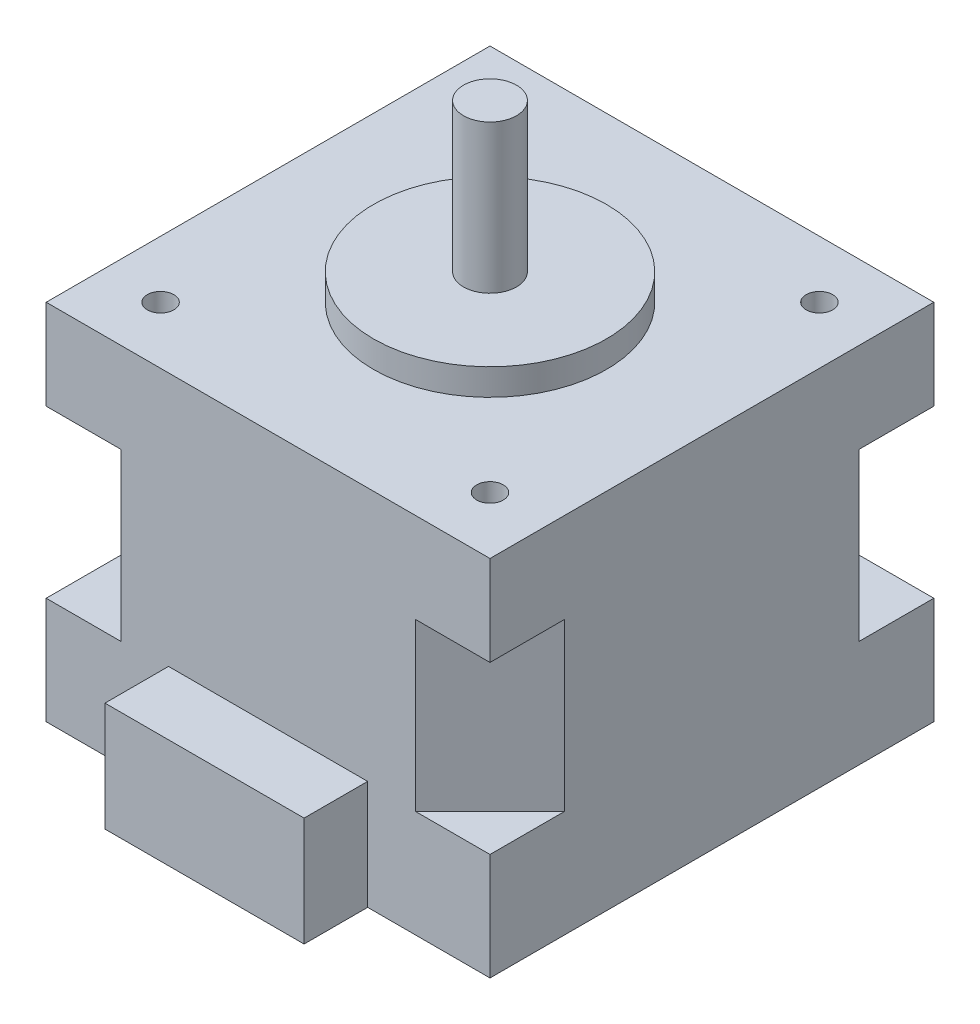
ISO-10303-21;
HEADER;
FILE_DESCRIPTION(('STEP AP214'),'2;1');
FILE_NAME('part.step','',(''),(''),'','','');
FILE_SCHEMA(('AUTOMOTIVE_DESIGN { 1 0 10303 214 1 1 1 1 }'));
ENDSEC;
DATA;
#1=APPLICATION_CONTEXT('core data for automotive mechanical design processes');
#2=APPLICATION_PROTOCOL_DEFINITION('international standard','automotive_design',2000,#1);
#3=PRODUCT_CONTEXT('',#1,'mechanical');
#4=PRODUCT('Part','Part','',(#3));
#5=PRODUCT_RELATED_PRODUCT_CATEGORY('part','',(#4));
#6=PRODUCT_DEFINITION_FORMATION('','',#4);
#7=PRODUCT_DEFINITION_CONTEXT('part definition',#1,'design');
#8=PRODUCT_DEFINITION('design','',#6,#7);
#9=PRODUCT_DEFINITION_SHAPE('','',#8);
#10=(LENGTH_UNIT() NAMED_UNIT(*) SI_UNIT(.MILLI.,.METRE.));
#11=(NAMED_UNIT(*) PLANE_ANGLE_UNIT() SI_UNIT($,.RADIAN.));
#12=(NAMED_UNIT(*) SI_UNIT($,.STERADIAN.) SOLID_ANGLE_UNIT());
#13=UNCERTAINTY_MEASURE_WITH_UNIT(LENGTH_MEASURE(1.E-05),#10,'distance_accuracy_value','');
#14=(GEOMETRIC_REPRESENTATION_CONTEXT(3) GLOBAL_UNCERTAINTY_ASSIGNED_CONTEXT((#13)) GLOBAL_UNIT_ASSIGNED_CONTEXT((#10,
#11,#12)) REPRESENTATION_CONTEXT('',''));
#15=CARTESIAN_POINT('',(0.,0.,0.));
#16=DIRECTION('',(0.,0.,1.));
#17=DIRECTION('',(1.,0.,0.));
#18=AXIS2_PLACEMENT_3D('',#15,#16,#17);
#19=CARTESIAN_POINT('',(-20.95,34.3,20.95));
#20=DIRECTION('',(0.,0.,-1.));
#21=DIRECTION('',(-1.,0.,0.));
#22=AXIS2_PLACEMENT_3D('',#19,#20,#21);
#23=PLANE('',#22);
#24=DIRECTION('',(0.,-1.,0.));
#25=VECTOR('',#24,1.);
#26=CARTESIAN_POINT('',(-9.4,10.3,20.95));
#27=LINE('',#26,#25);
#28=CARTESIAN_POINT('',(-9.4,10.3,20.95));
#29=VERTEX_POINT('',#28);
#30=CARTESIAN_POINT('',(-9.4,0.,20.95));
#31=VERTEX_POINT('',#30);
#32=EDGE_CURVE('E196',#29,#31,#27,.T.);
#33=ORIENTED_EDGE('',*,*,#32,.F.);
#34=DIRECTION('',(1.,0.,0.));
#35=VECTOR('',#34,1.);
#36=CARTESIAN_POINT('',(0.,10.3,20.95));
#37=LINE('',#36,#35);
#38=CARTESIAN_POINT('',(9.4,10.3,20.95));
#39=VERTEX_POINT('',#38);
#40=EDGE_CURVE('E189',#29,#39,#37,.T.);
#41=ORIENTED_EDGE('',*,*,#40,.T.);
#42=DIRECTION('',(0.,-1.,0.));
#43=VECTOR('',#42,1.);
#44=CARTESIAN_POINT('',(9.4,10.3,20.95));
#45=LINE('',#44,#43);
#46=CARTESIAN_POINT('',(9.4,0.,20.95));
#47=VERTEX_POINT('',#46);
#48=EDGE_CURVE('E175',#39,#47,#45,.T.);
#49=ORIENTED_EDGE('',*,*,#48,.T.);
#50=DIRECTION('',(1.,0.,0.));
#51=VECTOR('',#50,1.);
#52=CARTESIAN_POINT('',(-20.95,0.,20.95));
#53=LINE('',#52,#51);
#54=CARTESIAN_POINT('',(20.95,0.,20.95));
#55=VERTEX_POINT('',#54);
#56=EDGE_CURVE('E351',#47,#55,#53,.T.);
#57=ORIENTED_EDGE('',*,*,#56,.T.);
#58=DIRECTION('',(0.,-1.,0.));
#59=VECTOR('',#58,1.);
#60=CARTESIAN_POINT('',(20.95,34.3,20.95));
#61=LINE('',#60,#59);
#62=CARTESIAN_POINT('',(20.95,10.1,20.95));
#63=VERTEX_POINT('',#62);
#64=EDGE_CURVE('E342',#63,#55,#61,.T.);
#65=ORIENTED_EDGE('',*,*,#64,.F.);
#66=DIRECTION('',(1.,0.,0.));
#67=VECTOR('',#66,1.);
#68=CARTESIAN_POINT('',(13.9,10.1,20.95));
#69=LINE('',#68,#67);
#70=CARTESIAN_POINT('',(13.9,10.1,20.95));
#71=VERTEX_POINT('',#70);
#72=EDGE_CURVE('E219',#71,#63,#69,.T.);
#73=ORIENTED_EDGE('',*,*,#72,.F.);
#74=DIRECTION('',(0.,1.,0.));
#75=VECTOR('',#74,1.);
#76=CARTESIAN_POINT('',(13.9,10.1,20.95));
#77=LINE('',#76,#75);
#78=CARTESIAN_POINT('',(13.9,25.8,20.95));
#79=VERTEX_POINT('',#78);
#80=EDGE_CURVE('E232',#71,#79,#77,.T.);
#81=ORIENTED_EDGE('',*,*,#80,.T.);
#82=DIRECTION('',(1.,0.,0.));
#83=VECTOR('',#82,1.);
#84=CARTESIAN_POINT('',(13.9,25.8,20.95));
#85=LINE('',#84,#83);
#86=CARTESIAN_POINT('',(20.95,25.8,20.95));
#87=VERTEX_POINT('',#86);
#88=EDGE_CURVE('E227',#79,#87,#85,.T.);
#89=ORIENTED_EDGE('',*,*,#88,.T.);
#90=CARTESIAN_POINT('',(20.95,34.3,20.95));
#91=VERTEX_POINT('',#90);
#92=EDGE_CURVE('E353',#91,#87,#61,.T.);
#93=ORIENTED_EDGE('',*,*,#92,.F.);
#94=DIRECTION('',(1.,0.,0.));
#95=VECTOR('',#94,1.);
#96=CARTESIAN_POINT('',(-20.95,34.3,20.95));
#97=LINE('',#96,#95);
#98=CARTESIAN_POINT('',(-20.95,34.3,20.95));
#99=VERTEX_POINT('',#98);
#100=EDGE_CURVE('E340',#99,#91,#97,.T.);
#101=ORIENTED_EDGE('',*,*,#100,.F.);
#102=DIRECTION('',(0.,-1.,0.));
#103=VECTOR('',#102,1.);
#104=CARTESIAN_POINT('',(-20.95,34.3,20.95));
#105=LINE('',#104,#103);
#106=CARTESIAN_POINT('',(-20.95,25.8,20.95));
#107=VERTEX_POINT('',#106);
#108=EDGE_CURVE('E357',#99,#107,#105,.T.);
#109=ORIENTED_EDGE('',*,*,#108,.T.);
#110=DIRECTION('',(-1.,0.,0.));
#111=VECTOR('',#110,1.);
#112=CARTESIAN_POINT('',(-13.9,25.8,20.95));
#113=LINE('',#112,#111);
#114=CARTESIAN_POINT('',(-13.9,25.8,20.95));
#115=VERTEX_POINT('',#114);
#116=EDGE_CURVE('E240',#115,#107,#113,.T.);
#117=ORIENTED_EDGE('',*,*,#116,.F.);
#118=DIRECTION('',(0.,1.,0.));
#119=VECTOR('',#118,1.);
#120=CARTESIAN_POINT('',(-13.9,10.1,20.95));
#121=LINE('',#120,#119);
#122=CARTESIAN_POINT('',(-13.9,10.1,20.95));
#123=VERTEX_POINT('',#122);
#124=EDGE_CURVE('E245',#123,#115,#121,.T.);
#125=ORIENTED_EDGE('',*,*,#124,.F.);
#126=DIRECTION('',(-1.,0.,0.));
#127=VECTOR('',#126,1.);
#128=CARTESIAN_POINT('',(-13.9,10.1,20.95));
#129=LINE('',#128,#127);
#130=CARTESIAN_POINT('',(-20.95,10.1,20.95));
#131=VERTEX_POINT('',#130);
#132=EDGE_CURVE('E242',#123,#131,#129,.T.);
#133=ORIENTED_EDGE('',*,*,#132,.T.);
#134=CARTESIAN_POINT('',(-20.95,0.,20.95));
#135=VERTEX_POINT('',#134);
#136=EDGE_CURVE('E356',#131,#135,#105,.T.);
#137=ORIENTED_EDGE('',*,*,#136,.T.);
#138=EDGE_CURVE('E336',#135,#31,#53,.T.);
#139=ORIENTED_EDGE('',*,*,#138,.T.);
#140=EDGE_LOOP('',(#33,#41,#49,#57,#65,#73,#81,#89,#93,#101,#109,#117,#125,#133,#137,#139));
#141=FACE_BOUND('',#140,.T.);
#142=ADVANCED_FACE('F38',(#141),#23,.F.);
#143=CARTESIAN_POINT('',(20.95,34.3,-20.95));
#144=DIRECTION('',(-1.,0.,0.));
#145=DIRECTION('',(0.,0.,1.));
#146=AXIS2_PLACEMENT_3D('',#143,#144,#145);
#147=PLANE('',#146);
#148=DIRECTION('',(0.,0.,-1.));
#149=VECTOR('',#148,1.);
#150=CARTESIAN_POINT('',(20.95,10.1,20.95));
#151=LINE('',#150,#149);
#152=CARTESIAN_POINT('',(20.95,10.1,13.9));
#153=VERTEX_POINT('',#152);
#154=EDGE_CURVE('E217',#63,#153,#151,.T.);
#155=ORIENTED_EDGE('',*,*,#154,.F.);
#156=ORIENTED_EDGE('',*,*,#64,.T.);
#157=DIRECTION('',(0.,0.,-1.));
#158=VECTOR('',#157,1.);
#159=CARTESIAN_POINT('',(20.95,0.,-20.95));
#160=LINE('',#159,#158);
#161=CARTESIAN_POINT('',(20.95,0.,-20.95));
#162=VERTEX_POINT('',#161);
#163=EDGE_CURVE('E329',#55,#162,#160,.T.);
#164=ORIENTED_EDGE('',*,*,#163,.T.);
#165=DIRECTION('',(0.,-1.,0.));
#166=VECTOR('',#165,1.);
#167=CARTESIAN_POINT('',(20.95,34.3,-20.95));
#168=LINE('',#167,#166);
#169=CARTESIAN_POINT('',(20.95,10.1,-20.95));
#170=VERTEX_POINT('',#169);
#171=EDGE_CURVE('E362',#170,#162,#168,.T.);
#172=ORIENTED_EDGE('',*,*,#171,.F.);
#173=DIRECTION('',(0.,0.,1.));
#174=VECTOR('',#173,1.);
#175=CARTESIAN_POINT('',(20.95,10.1,-20.95));
#176=LINE('',#175,#174);
#177=CARTESIAN_POINT('',(20.95,10.1,-13.9));
#178=VERTEX_POINT('',#177);
#179=EDGE_CURVE('E279',#170,#178,#176,.T.);
#180=ORIENTED_EDGE('',*,*,#179,.T.);
#181=DIRECTION('',(0.,1.,0.));
#182=VECTOR('',#181,1.);
#183=CARTESIAN_POINT('',(20.95,10.1,-13.9));
#184=LINE('',#183,#182);
#185=CARTESIAN_POINT('',(20.95,25.8,-13.9));
#186=VERTEX_POINT('',#185);
#187=EDGE_CURVE('E296',#178,#186,#184,.T.);
#188=ORIENTED_EDGE('',*,*,#187,.T.);
#189=DIRECTION('',(0.,0.,1.));
#190=VECTOR('',#189,1.);
#191=CARTESIAN_POINT('',(20.95,25.8,-20.95));
#192=LINE('',#191,#190);
#193=CARTESIAN_POINT('',(20.95,25.8,-20.95));
#194=VERTEX_POINT('',#193);
#195=EDGE_CURVE('E278',#194,#186,#192,.T.);
#196=ORIENTED_EDGE('',*,*,#195,.F.);
#197=CARTESIAN_POINT('',(20.95,34.3,-20.95));
#198=VERTEX_POINT('',#197);
#199=EDGE_CURVE('E42',#198,#194,#168,.T.);
#200=ORIENTED_EDGE('',*,*,#199,.F.);
#201=DIRECTION('',(0.,0.,-1.));
#202=VECTOR('',#201,1.);
#203=CARTESIAN_POINT('',(20.95,34.3,-20.95));
#204=LINE('',#203,#202);
#205=EDGE_CURVE('E332',#91,#198,#204,.T.);
#206=ORIENTED_EDGE('',*,*,#205,.F.);
#207=ORIENTED_EDGE('',*,*,#92,.T.);
#208=DIRECTION('',(0.,0.,-1.));
#209=VECTOR('',#208,1.);
#210=CARTESIAN_POINT('',(20.95,25.8,20.95));
#211=LINE('',#210,#209);
#212=CARTESIAN_POINT('',(20.95,25.8,13.9));
#213=VERTEX_POINT('',#212);
#214=EDGE_CURVE('E213',#87,#213,#211,.T.);
#215=ORIENTED_EDGE('',*,*,#214,.T.);
#216=DIRECTION('',(0.,1.,0.));
#217=VECTOR('',#216,1.);
#218=CARTESIAN_POINT('',(20.95,10.1,13.9));
#219=LINE('',#218,#217);
#220=EDGE_CURVE('E224',#153,#213,#219,.T.);
#221=ORIENTED_EDGE('',*,*,#220,.F.);
#222=EDGE_LOOP('',(#155,#156,#164,#172,#180,#188,#196,#200,#206,#207,#215,#221));
#223=FACE_BOUND('',#222,.T.);
#224=ADVANCED_FACE('F40',(#223),#147,.F.);
#225=CARTESIAN_POINT('',(-20.95,34.3,-20.95));
#226=DIRECTION('',(1.,0.,0.));
#227=DIRECTION('',(0.,0.,-1.));
#228=AXIS2_PLACEMENT_3D('',#225,#226,#227);
#229=PLANE('',#228);
#230=DIRECTION('',(0.,0.,-1.));
#231=VECTOR('',#230,1.);
#232=CARTESIAN_POINT('',(-20.95,10.1,20.95));
#233=LINE('',#232,#231);
#234=CARTESIAN_POINT('',(-20.95,10.1,13.9));
#235=VERTEX_POINT('',#234);
#236=EDGE_CURVE('E236',#131,#235,#233,.T.);
#237=ORIENTED_EDGE('',*,*,#236,.T.);
#238=DIRECTION('',(0.,1.,0.));
#239=VECTOR('',#238,1.);
#240=CARTESIAN_POINT('',(-20.95,10.1,13.9));
#241=LINE('',#240,#239);
#242=CARTESIAN_POINT('',(-20.95,25.8,13.9));
#243=VERTEX_POINT('',#242);
#244=EDGE_CURVE('E253',#235,#243,#241,.T.);
#245=ORIENTED_EDGE('',*,*,#244,.T.);
#246=DIRECTION('',(0.,0.,-1.));
#247=VECTOR('',#246,1.);
#248=CARTESIAN_POINT('',(-20.95,25.8,20.95));
#249=LINE('',#248,#247);
#250=EDGE_CURVE('E235',#107,#243,#249,.T.);
#251=ORIENTED_EDGE('',*,*,#250,.F.);
#252=ORIENTED_EDGE('',*,*,#108,.F.);
#253=DIRECTION('',(0.,0.,1.));
#254=VECTOR('',#253,1.);
#255=CARTESIAN_POINT('',(-20.95,34.3,-20.95));
#256=LINE('',#255,#254);
#257=CARTESIAN_POINT('',(-20.95,34.3,-20.95));
#258=VERTEX_POINT('',#257);
#259=EDGE_CURVE('E338',#258,#99,#256,.T.);
#260=ORIENTED_EDGE('',*,*,#259,.F.);
#261=DIRECTION('',(0.,-1.,0.));
#262=VECTOR('',#261,1.);
#263=CARTESIAN_POINT('',(-20.95,34.3,-20.95));
#264=LINE('',#263,#262);
#265=CARTESIAN_POINT('',(-20.95,25.8,-20.95));
#266=VERTEX_POINT('',#265);
#267=EDGE_CURVE('E360',#258,#266,#264,.T.);
#268=ORIENTED_EDGE('',*,*,#267,.T.);
#269=DIRECTION('',(0.,0.,1.));
#270=VECTOR('',#269,1.);
#271=CARTESIAN_POINT('',(-20.95,25.8,-20.95));
#272=LINE('',#271,#270);
#273=CARTESIAN_POINT('',(-20.95,25.8,-13.9));
#274=VERTEX_POINT('',#273);
#275=EDGE_CURVE('E256',#266,#274,#272,.T.);
#276=ORIENTED_EDGE('',*,*,#275,.T.);
#277=DIRECTION('',(0.,1.,0.));
#278=VECTOR('',#277,1.);
#279=CARTESIAN_POINT('',(-20.95,10.1,-13.9));
#280=LINE('',#279,#278);
#281=CARTESIAN_POINT('',(-20.95,10.1,-13.9));
#282=VERTEX_POINT('',#281);
#283=EDGE_CURVE('E265',#282,#274,#280,.T.);
#284=ORIENTED_EDGE('',*,*,#283,.F.);
#285=DIRECTION('',(0.,0.,1.));
#286=VECTOR('',#285,1.);
#287=CARTESIAN_POINT('',(-20.95,10.1,-20.95));
#288=LINE('',#287,#286);
#289=CARTESIAN_POINT('',(-20.95,10.1,-20.95));
#290=VERTEX_POINT('',#289);
#291=EDGE_CURVE('E257',#290,#282,#288,.T.);
#292=ORIENTED_EDGE('',*,*,#291,.F.);
#293=CARTESIAN_POINT('',(-20.95,0.,-20.95));
#294=VERTEX_POINT('',#293);
#295=EDGE_CURVE('E359',#290,#294,#264,.T.);
#296=ORIENTED_EDGE('',*,*,#295,.T.);
#297=DIRECTION('',(0.,0.,1.));
#298=VECTOR('',#297,1.);
#299=CARTESIAN_POINT('',(-20.95,0.,-20.95));
#300=LINE('',#299,#298);
#301=EDGE_CURVE('E348',#294,#135,#300,.T.);
#302=ORIENTED_EDGE('',*,*,#301,.T.);
#303=ORIENTED_EDGE('',*,*,#136,.F.);
#304=EDGE_LOOP('',(#237,#245,#251,#252,#260,#268,#276,#284,#292,#296,#302,#303));
#305=FACE_BOUND('',#304,.T.);
#306=ADVANCED_FACE('F368',(#305),#229,.F.);
#307=CARTESIAN_POINT('',(-20.95,34.3,-20.95));
#308=DIRECTION('',(0.,0.,1.));
#309=DIRECTION('',(1.,0.,0.));
#310=AXIS2_PLACEMENT_3D('',#307,#308,#309);
#311=PLANE('',#310);
#312=DIRECTION('',(-1.,0.,0.));
#313=VECTOR('',#312,1.);
#314=CARTESIAN_POINT('',(-13.9,10.1,-20.95));
#315=LINE('',#314,#313);
#316=CARTESIAN_POINT('',(-13.9,10.1,-20.95));
#317=VERTEX_POINT('',#316);
#318=EDGE_CURVE('E259',#317,#290,#315,.T.);
#319=ORIENTED_EDGE('',*,*,#318,.F.);
#320=DIRECTION('',(0.,1.,0.));
#321=VECTOR('',#320,1.);
#322=CARTESIAN_POINT('',(-13.9,10.1,-20.95));
#323=LINE('',#322,#321);
#324=CARTESIAN_POINT('',(-13.9,25.8,-20.95));
#325=VERTEX_POINT('',#324);
#326=EDGE_CURVE('E275',#317,#325,#323,.T.);
#327=ORIENTED_EDGE('',*,*,#326,.T.);
#328=DIRECTION('',(-1.,0.,0.));
#329=VECTOR('',#328,1.);
#330=CARTESIAN_POINT('',(-13.9,25.8,-20.95));
#331=LINE('',#330,#329);
#332=EDGE_CURVE('E268',#325,#266,#331,.T.);
#333=ORIENTED_EDGE('',*,*,#332,.T.);
#334=ORIENTED_EDGE('',*,*,#267,.F.);
#335=DIRECTION('',(-1.,0.,0.));
#336=VECTOR('',#335,1.);
#337=CARTESIAN_POINT('',(-20.95,34.3,-20.95));
#338=LINE('',#337,#336);
#339=EDGE_CURVE('E335',#198,#258,#338,.T.);
#340=ORIENTED_EDGE('',*,*,#339,.F.);
#341=ORIENTED_EDGE('',*,*,#199,.T.);
#342=DIRECTION('',(1.,0.,0.));
#343=VECTOR('',#342,1.);
#344=CARTESIAN_POINT('',(13.9,25.8,-20.95));
#345=LINE('',#344,#343);
#346=CARTESIAN_POINT('',(13.9,25.8,-20.95));
#347=VERTEX_POINT('',#346);
#348=EDGE_CURVE('E283',#347,#194,#345,.T.);
#349=ORIENTED_EDGE('',*,*,#348,.F.);
#350=DIRECTION('',(0.,1.,0.));
#351=VECTOR('',#350,1.);
#352=CARTESIAN_POINT('',(13.9,10.1,-20.95));
#353=LINE('',#352,#351);
#354=CARTESIAN_POINT('',(13.9,10.1,-20.95));
#355=VERTEX_POINT('',#354);
#356=EDGE_CURVE('E288',#355,#347,#353,.T.);
#357=ORIENTED_EDGE('',*,*,#356,.F.);
#358=DIRECTION('',(1.,0.,0.));
#359=VECTOR('',#358,1.);
#360=CARTESIAN_POINT('',(13.9,10.1,-20.95));
#361=LINE('',#360,#359);
#362=EDGE_CURVE('E285',#355,#170,#361,.T.);
#363=ORIENTED_EDGE('',*,*,#362,.T.);
#364=ORIENTED_EDGE('',*,*,#171,.T.);
#365=DIRECTION('',(-1.,0.,0.));
#366=VECTOR('',#365,1.);
#367=CARTESIAN_POINT('',(-20.95,0.,-20.95));
#368=LINE('',#367,#366);
#369=EDGE_CURVE('E345',#162,#294,#368,.T.);
#370=ORIENTED_EDGE('',*,*,#369,.T.);
#371=ORIENTED_EDGE('',*,*,#295,.F.);
#372=EDGE_LOOP('',(#319,#327,#333,#334,#340,#341,#349,#357,#363,#364,#370,#371));
#373=FACE_BOUND('',#372,.T.);
#374=ADVANCED_FACE('F376',(#373),#311,.F.);
#375=CARTESIAN_POINT('',(0.,34.3,0.));
#376=DIRECTION('',(0.,1.,0.));
#377=DIRECTION('',(0.,0.,1.));
#378=AXIS2_PLACEMENT_3D('',#375,#376,#377);
#379=PLANE('',#378);
#380=CARTESIAN_POINT('',(15.55,34.3,15.55));
#381=DIRECTION('',(0.,-1.,0.));
#382=DIRECTION('',(0.,0.,-1.));
#383=AXIS2_PLACEMENT_3D('',#380,#381,#382);
#384=CIRCLE('',#383,1.25);
#385=CARTESIAN_POINT('',(15.55,34.3,14.3));
#386=VERTEX_POINT('',#385);
#387=EDGE_CURVE('E299',#386,#386,#384,.T.);
#388=ORIENTED_EDGE('',*,*,#387,.T.);
#389=EDGE_LOOP('',(#388));
#390=FACE_BOUND('',#389,.T.);
#391=CARTESIAN_POINT('',(-15.55,34.3,15.55));
#392=DIRECTION('',(0.,1.,0.));
#393=DIRECTION('',(0.,0.,-1.));
#394=AXIS2_PLACEMENT_3D('',#391,#392,#393);
#395=CIRCLE('',#394,1.25);
#396=CARTESIAN_POINT('',(-15.55,34.3,14.3));
#397=VERTEX_POINT('',#396);
#398=EDGE_CURVE('E303',#397,#397,#395,.T.);
#399=ORIENTED_EDGE('',*,*,#398,.F.);
#400=EDGE_LOOP('',(#399));
#401=FACE_BOUND('',#400,.T.);
#402=CARTESIAN_POINT('',(-15.55,34.3,-15.55));
#403=DIRECTION('',(0.,-1.,0.));
#404=DIRECTION('',(0.,0.,1.));
#405=AXIS2_PLACEMENT_3D('',#402,#403,#404);
#406=CIRCLE('',#405,1.25);
#407=CARTESIAN_POINT('',(-15.55,34.3,-14.3));
#408=VERTEX_POINT('',#407);
#409=EDGE_CURVE('E309',#408,#408,#406,.T.);
#410=ORIENTED_EDGE('',*,*,#409,.T.);
#411=EDGE_LOOP('',(#410));
#412=FACE_BOUND('',#411,.T.);
#413=CARTESIAN_POINT('',(15.55,34.3,-15.55));
#414=DIRECTION('',(0.,1.,0.));
#415=DIRECTION('',(0.,0.,1.));
#416=AXIS2_PLACEMENT_3D('',#413,#414,#415);
#417=CIRCLE('',#416,1.25);
#418=CARTESIAN_POINT('',(15.55,34.3,-14.3));
#419=VERTEX_POINT('',#418);
#420=EDGE_CURVE('E315',#419,#419,#417,.T.);
#421=ORIENTED_EDGE('',*,*,#420,.F.);
#422=EDGE_LOOP('',(#421));
#423=FACE_BOUND('',#422,.T.);
#424=CARTESIAN_POINT('',(0.,34.3,0.));
#425=DIRECTION('',(0.,1.,0.));
#426=DIRECTION('',(0.,0.,1.));
#427=AXIS2_PLACEMENT_3D('',#424,#425,#426);
#428=CIRCLE('',#427,11.);
#429=CARTESIAN_POINT('',(0.,34.3,11.));
#430=VERTEX_POINT('',#429);
#431=EDGE_CURVE('E47',#430,#430,#428,.T.);
#432=ORIENTED_EDGE('',*,*,#431,.F.);
#433=EDGE_LOOP('',(#432));
#434=FACE_BOUND('',#433,.T.);
#435=ORIENTED_EDGE('',*,*,#205,.T.);
#436=ORIENTED_EDGE('',*,*,#339,.T.);
#437=ORIENTED_EDGE('',*,*,#259,.T.);
#438=ORIENTED_EDGE('',*,*,#100,.T.);
#439=EDGE_LOOP('',(#435,#436,#437,#438));
#440=FACE_BOUND('',#439,.T.);
#441=ADVANCED_FACE('F398',(#390,#401,#412,#423,#434,#440),#379,.T.);
#442=CARTESIAN_POINT('',(0.,0.,0.));
#443=DIRECTION('',(0.,1.,0.));
#444=DIRECTION('',(0.,0.,1.));
#445=AXIS2_PLACEMENT_3D('',#442,#443,#444);
#446=PLANE('',#445);
#447=CARTESIAN_POINT('',(0.,0.,0.));
#448=DIRECTION('',(0.,-1.,0.));
#449=DIRECTION('',(0.,0.,-1.));
#450=AXIS2_PLACEMENT_3D('',#447,#448,#449);
#451=CIRCLE('',#450,4.);
#452=CARTESIAN_POINT('',(0.,0.,-4.));
#453=VERTEX_POINT('',#452);
#454=EDGE_CURVE('E203',#453,#453,#451,.T.);
#455=ORIENTED_EDGE('',*,*,#454,.F.);
#456=EDGE_LOOP('',(#455));
#457=FACE_BOUND('',#456,.T.);
#458=ORIENTED_EDGE('',*,*,#163,.F.);
#459=ORIENTED_EDGE('',*,*,#56,.F.);
#460=DIRECTION('',(0.,0.,1.));
#461=VECTOR('',#460,1.);
#462=CARTESIAN_POINT('',(9.4,0.,26.95));
#463=LINE('',#462,#461);
#464=CARTESIAN_POINT('',(9.4,0.,26.95));
#465=VERTEX_POINT('',#464);
#466=EDGE_CURVE('E55',#47,#465,#463,.T.);
#467=ORIENTED_EDGE('',*,*,#466,.T.);
#468=DIRECTION('',(-1.,0.,0.));
#469=VECTOR('',#468,1.);
#470=CARTESIAN_POINT('',(-9.4,0.,26.95));
#471=LINE('',#470,#469);
#472=CARTESIAN_POINT('',(-9.4,0.,26.95));
#473=VERTEX_POINT('',#472);
#474=EDGE_CURVE('E200',#465,#473,#471,.T.);
#475=ORIENTED_EDGE('',*,*,#474,.T.);
#476=DIRECTION('',(0.,0.,-1.));
#477=VECTOR('',#476,1.);
#478=CARTESIAN_POINT('',(-9.4,0.,20.95));
#479=LINE('',#478,#477);
#480=EDGE_CURVE('E197',#473,#31,#479,.T.);
#481=ORIENTED_EDGE('',*,*,#480,.T.);
#482=ORIENTED_EDGE('',*,*,#138,.F.);
#483=ORIENTED_EDGE('',*,*,#301,.F.);
#484=ORIENTED_EDGE('',*,*,#369,.F.);
#485=EDGE_LOOP('',(#458,#459,#467,#475,#481,#482,#483,#484));
#486=FACE_BOUND('',#485,.T.);
#487=ADVANCED_FACE('F380',(#457,#486),#446,.F.);
#488=CARTESIAN_POINT('',(0.,36.8,0.));
#489=DIRECTION('',(0.,-1.,0.));
#490=DIRECTION('',(0.,0.,-1.));
#491=AXIS2_PLACEMENT_3D('',#488,#489,#490);
#492=CYLINDRICAL_SURFACE('',#491,11.);
#493=CARTESIAN_POINT('',(0.,36.8,0.));
#494=DIRECTION('',(0.,1.,0.));
#495=DIRECTION('',(0.,0.,1.));
#496=AXIS2_PLACEMENT_3D('',#493,#494,#495);
#497=CIRCLE('',#496,11.);
#498=CARTESIAN_POINT('',(0.,36.8,11.));
#499=VERTEX_POINT('',#498);
#500=EDGE_CURVE('E325',#499,#499,#497,.T.);
#501=ORIENTED_EDGE('',*,*,#500,.F.);
#502=EDGE_LOOP('',(#501));
#503=FACE_BOUND('',#502,.T.);
#504=ORIENTED_EDGE('',*,*,#431,.T.);
#505=EDGE_LOOP('',(#504));
#506=FACE_BOUND('',#505,.T.);
#507=ADVANCED_FACE('F436',(#503,#506),#492,.T.);
#508=CARTESIAN_POINT('',(0.,36.8,0.));
#509=DIRECTION('',(0.,1.,0.));
#510=DIRECTION('',(0.,0.,1.));
#511=AXIS2_PLACEMENT_3D('',#508,#509,#510);
#512=PLANE('',#511);
#513=CARTESIAN_POINT('',(0.,36.8,0.));
#514=DIRECTION('',(0.,1.,0.));
#515=DIRECTION('',(0.,0.,1.));
#516=AXIS2_PLACEMENT_3D('',#513,#514,#515);
#517=CIRCLE('',#516,2.5);
#518=CARTESIAN_POINT('',(0.,36.8,2.5));
#519=VERTEX_POINT('',#518);
#520=EDGE_CURVE('E11',#519,#519,#517,.T.);
#521=ORIENTED_EDGE('',*,*,#520,.F.);
#522=EDGE_LOOP('',(#521));
#523=FACE_BOUND('',#522,.T.);
#524=ORIENTED_EDGE('',*,*,#500,.T.);
#525=EDGE_LOOP('',(#524));
#526=FACE_BOUND('',#525,.T.);
#527=ADVANCED_FACE('F442',(#523,#526),#512,.T.);
#528=CARTESIAN_POINT('',(0.,50.8,0.));
#529=DIRECTION('',(0.,-1.,0.));
#530=DIRECTION('',(0.,0.,-1.));
#531=AXIS2_PLACEMENT_3D('',#528,#529,#530);
#532=CYLINDRICAL_SURFACE('',#531,2.5);
#533=CARTESIAN_POINT('',(0.,50.8,0.));
#534=DIRECTION('',(0.,1.,0.));
#535=DIRECTION('',(0.,0.,1.));
#536=AXIS2_PLACEMENT_3D('',#533,#534,#535);
#537=CIRCLE('',#536,2.5);
#538=CARTESIAN_POINT('',(0.,50.8,2.5));
#539=VERTEX_POINT('',#538);
#540=EDGE_CURVE('E321',#539,#539,#537,.T.);
#541=ORIENTED_EDGE('',*,*,#540,.F.);
#542=EDGE_LOOP('',(#541));
#543=FACE_BOUND('',#542,.T.);
#544=ORIENTED_EDGE('',*,*,#520,.T.);
#545=EDGE_LOOP('',(#544));
#546=FACE_BOUND('',#545,.T.);
#547=ADVANCED_FACE('F446',(#543,#546),#532,.T.);
#548=CARTESIAN_POINT('',(0.,50.8,0.));
#549=DIRECTION('',(0.,1.,0.));
#550=DIRECTION('',(0.,0.,1.));
#551=AXIS2_PLACEMENT_3D('',#548,#549,#550);
#552=PLANE('',#551);
#553=ORIENTED_EDGE('',*,*,#540,.T.);
#554=EDGE_LOOP('',(#553));
#555=FACE_BOUND('',#554,.T.);
#556=ADVANCED_FACE('F450',(#555),#552,.T.);
#557=CARTESIAN_POINT('',(15.55,26.4,-15.55));
#558=DIRECTION('',(0.,1.,0.));
#559=DIRECTION('',(0.,0.,1.));
#560=AXIS2_PLACEMENT_3D('',#557,#558,#559);
#561=CYLINDRICAL_SURFACE('',#560,1.25);
#562=CARTESIAN_POINT('',(15.55,26.4,-15.55));
#563=DIRECTION('',(0.,1.,0.));
#564=DIRECTION('',(0.,0.,1.));
#565=AXIS2_PLACEMENT_3D('',#562,#563,#564);
#566=CIRCLE('',#565,1.25);
#567=CARTESIAN_POINT('',(15.55,26.4,-14.3));
#568=VERTEX_POINT('',#567);
#569=EDGE_CURVE('E318',#568,#568,#566,.T.);
#570=ORIENTED_EDGE('',*,*,#569,.F.);
#571=EDGE_LOOP('',(#570));
#572=FACE_BOUND('',#571,.T.);
#573=ORIENTED_EDGE('',*,*,#420,.T.);
#574=EDGE_LOOP('',(#573));
#575=FACE_BOUND('',#574,.T.);
#576=ADVANCED_FACE('F454',(#572,#575),#561,.F.);
#577=CARTESIAN_POINT('',(15.55,26.4,-15.55));
#578=DIRECTION('',(0.,1.,0.));
#579=DIRECTION('',(0.,0.,1.));
#580=AXIS2_PLACEMENT_3D('',#577,#578,#579);
#581=PLANE('',#580);
#582=ORIENTED_EDGE('',*,*,#569,.T.);
#583=EDGE_LOOP('',(#582));
#584=FACE_BOUND('',#583,.T.);
#585=ADVANCED_FACE('F458',(#584),#581,.T.);
#586=CARTESIAN_POINT('',(-15.55,26.4,-15.55));
#587=DIRECTION('',(0.,1.,0.));
#588=DIRECTION('',(0.,0.,1.));
#589=AXIS2_PLACEMENT_3D('',#586,#587,#588);
#590=CYLINDRICAL_SURFACE('',#589,1.25);
#591=CARTESIAN_POINT('',(-15.55,26.4,-15.55));
#592=DIRECTION('',(0.,-1.,0.));
#593=DIRECTION('',(0.,0.,1.));
#594=AXIS2_PLACEMENT_3D('',#591,#592,#593);
#595=CIRCLE('',#594,1.25);
#596=CARTESIAN_POINT('',(-15.55,26.4,-14.3));
#597=VERTEX_POINT('',#596);
#598=EDGE_CURVE('E312',#597,#597,#595,.T.);
#599=ORIENTED_EDGE('',*,*,#598,.T.);
#600=EDGE_LOOP('',(#599));
#601=FACE_BOUND('',#600,.T.);
#602=ORIENTED_EDGE('',*,*,#409,.F.);
#603=EDGE_LOOP('',(#602));
#604=FACE_BOUND('',#603,.T.);
#605=ADVANCED_FACE('F462',(#601,#604),#590,.F.);
#606=CARTESIAN_POINT('',(-15.55,26.4,-15.55));
#607=DIRECTION('',(0.,1.,0.));
#608=DIRECTION('',(0.,0.,1.));
#609=AXIS2_PLACEMENT_3D('',#606,#607,#608);
#610=PLANE('',#609);
#611=ORIENTED_EDGE('',*,*,#598,.F.);
#612=EDGE_LOOP('',(#611));
#613=FACE_BOUND('',#612,.T.);
#614=ADVANCED_FACE('F466',(#613),#610,.T.);
#615=CARTESIAN_POINT('',(-15.55,26.4,15.55));
#616=DIRECTION('',(0.,1.,0.));
#617=DIRECTION('',(0.,0.,1.));
#618=AXIS2_PLACEMENT_3D('',#615,#616,#617);
#619=CYLINDRICAL_SURFACE('',#618,1.25);
#620=CARTESIAN_POINT('',(-15.55,26.4,15.55));
#621=DIRECTION('',(0.,1.,0.));
#622=DIRECTION('',(0.,0.,-1.));
#623=AXIS2_PLACEMENT_3D('',#620,#621,#622);
#624=CIRCLE('',#623,1.25);
#625=CARTESIAN_POINT('',(-15.55,26.4,14.3));
#626=VERTEX_POINT('',#625);
#627=EDGE_CURVE('E306',#626,#626,#624,.T.);
#628=ORIENTED_EDGE('',*,*,#627,.F.);
#629=EDGE_LOOP('',(#628));
#630=FACE_BOUND('',#629,.T.);
#631=ORIENTED_EDGE('',*,*,#398,.T.);
#632=EDGE_LOOP('',(#631));
#633=FACE_BOUND('',#632,.T.);
#634=ADVANCED_FACE('F470',(#630,#633),#619,.F.);
#635=CARTESIAN_POINT('',(-15.55,26.4,15.55));
#636=DIRECTION('',(0.,1.,0.));
#637=DIRECTION('',(0.,0.,-1.));
#638=AXIS2_PLACEMENT_3D('',#635,#636,#637);
#639=PLANE('',#638);
#640=ORIENTED_EDGE('',*,*,#627,.T.);
#641=EDGE_LOOP('',(#640));
#642=FACE_BOUND('',#641,.T.);
#643=ADVANCED_FACE('F474',(#642),#639,.T.);
#644=CARTESIAN_POINT('',(15.55,26.4,15.55));
#645=DIRECTION('',(0.,1.,0.));
#646=DIRECTION('',(0.,0.,1.));
#647=AXIS2_PLACEMENT_3D('',#644,#645,#646);
#648=CYLINDRICAL_SURFACE('',#647,1.25);
#649=CARTESIAN_POINT('',(15.55,26.4,15.55));
#650=DIRECTION('',(0.,-1.,0.));
#651=DIRECTION('',(0.,0.,-1.));
#652=AXIS2_PLACEMENT_3D('',#649,#650,#651);
#653=CIRCLE('',#652,1.25);
#654=CARTESIAN_POINT('',(15.55,26.4,14.3));
#655=VERTEX_POINT('',#654);
#656=EDGE_CURVE('E300',#655,#655,#653,.T.);
#657=ORIENTED_EDGE('',*,*,#656,.T.);
#658=EDGE_LOOP('',(#657));
#659=FACE_BOUND('',#658,.T.);
#660=ORIENTED_EDGE('',*,*,#387,.F.);
#661=EDGE_LOOP('',(#660));
#662=FACE_BOUND('',#661,.T.);
#663=ADVANCED_FACE('F478',(#659,#662),#648,.F.);
#664=CARTESIAN_POINT('',(15.55,26.4,15.55));
#665=DIRECTION('',(0.,1.,0.));
#666=DIRECTION('',(0.,0.,-1.));
#667=AXIS2_PLACEMENT_3D('',#664,#665,#666);
#668=PLANE('',#667);
#669=ORIENTED_EDGE('',*,*,#656,.F.);
#670=EDGE_LOOP('',(#669));
#671=FACE_BOUND('',#670,.T.);
#672=ADVANCED_FACE('F482',(#671),#668,.T.);
#673=CARTESIAN_POINT('',(20.95,10.1,-13.9));
#674=DIRECTION('',(0.707106781186547,0.,-0.707106781186547));
#675=DIRECTION('',(-0.707106781186548,0.,-0.707106781186548));
#676=AXIS2_PLACEMENT_3D('',#673,#674,#675);
#677=PLANE('',#676);
#678=DIRECTION('',(-0.707106781186547,0.,-0.707106781186547));
#679=VECTOR('',#678,1.);
#680=CARTESIAN_POINT('',(20.95,25.8,-13.9));
#681=LINE('',#680,#679);
#682=EDGE_CURVE('E291',#186,#347,#681,.T.);
#683=ORIENTED_EDGE('',*,*,#682,.F.);
#684=ORIENTED_EDGE('',*,*,#187,.F.);
#685=DIRECTION('',(-0.707106781186547,0.,-0.707106781186547));
#686=VECTOR('',#685,1.);
#687=CARTESIAN_POINT('',(20.95,10.1,-13.9));
#688=LINE('',#687,#686);
#689=EDGE_CURVE('E282',#178,#355,#688,.T.);
#690=ORIENTED_EDGE('',*,*,#689,.T.);
#691=ORIENTED_EDGE('',*,*,#356,.T.);
#692=EDGE_LOOP('',(#683,#684,#690,#691));
#693=FACE_BOUND('',#692,.T.);
#694=ADVANCED_FACE('F486',(#693),#677,.T.);
#695=CARTESIAN_POINT('',(0.,10.1,0.));
#696=DIRECTION('',(0.,1.,0.));
#697=DIRECTION('',(0.,0.,1.));
#698=AXIS2_PLACEMENT_3D('',#695,#696,#697);
#699=PLANE('',#698);
#700=ORIENTED_EDGE('',*,*,#179,.F.);
#701=ORIENTED_EDGE('',*,*,#362,.F.);
#702=ORIENTED_EDGE('',*,*,#689,.F.);
#703=EDGE_LOOP('',(#700,#701,#702));
#704=FACE_BOUND('',#703,.T.);
#705=ADVANCED_FACE('F490',(#704),#699,.T.);
#706=CARTESIAN_POINT('',(0.,25.8,0.));
#707=DIRECTION('',(0.,1.,0.));
#708=DIRECTION('',(0.,0.,1.));
#709=AXIS2_PLACEMENT_3D('',#706,#707,#708);
#710=PLANE('',#709);
#711=ORIENTED_EDGE('',*,*,#195,.T.);
#712=ORIENTED_EDGE('',*,*,#682,.T.);
#713=ORIENTED_EDGE('',*,*,#348,.T.);
#714=EDGE_LOOP('',(#711,#712,#713));
#715=FACE_BOUND('',#714,.T.);
#716=ADVANCED_FACE('F415',(#715),#710,.F.);
#717=CARTESIAN_POINT('',(-20.95,10.1,-13.9));
#718=DIRECTION('',(0.707106781186547,0.,0.707106781186547));
#719=DIRECTION('',(0.707106781186548,0.,-0.707106781186548));
#720=AXIS2_PLACEMENT_3D('',#717,#718,#719);
#721=PLANE('',#720);
#722=DIRECTION('',(0.707106781186547,0.,-0.707106781186547));
#723=VECTOR('',#722,1.);
#724=CARTESIAN_POINT('',(-20.95,25.8,-13.9));
#725=LINE('',#724,#723);
#726=EDGE_CURVE('E260',#274,#325,#725,.T.);
#727=ORIENTED_EDGE('',*,*,#726,.T.);
#728=ORIENTED_EDGE('',*,*,#326,.F.);
#729=DIRECTION('',(0.707106781186547,0.,-0.707106781186547));
#730=VECTOR('',#729,1.);
#731=CARTESIAN_POINT('',(-20.95,10.1,-13.9));
#732=LINE('',#731,#730);
#733=EDGE_CURVE('E262',#282,#317,#732,.T.);
#734=ORIENTED_EDGE('',*,*,#733,.F.);
#735=ORIENTED_EDGE('',*,*,#283,.T.);
#736=EDGE_LOOP('',(#727,#728,#734,#735));
#737=FACE_BOUND('',#736,.T.);
#738=ADVANCED_FACE('F404',(#737),#721,.F.);
#739=CARTESIAN_POINT('',(0.,10.1,0.));
#740=DIRECTION('',(0.,1.,0.));
#741=DIRECTION('',(0.,0.,1.));
#742=AXIS2_PLACEMENT_3D('',#739,#740,#741);
#743=PLANE('',#742);
#744=ORIENTED_EDGE('',*,*,#291,.T.);
#745=ORIENTED_EDGE('',*,*,#733,.T.);
#746=ORIENTED_EDGE('',*,*,#318,.T.);
#747=EDGE_LOOP('',(#744,#745,#746));
#748=FACE_BOUND('',#747,.T.);
#749=ADVANCED_FACE('F407',(#748),#743,.T.);
#750=CARTESIAN_POINT('',(0.,25.8,0.));
#751=DIRECTION('',(0.,1.,0.));
#752=DIRECTION('',(0.,0.,1.));
#753=AXIS2_PLACEMENT_3D('',#750,#751,#752);
#754=PLANE('',#753);
#755=ORIENTED_EDGE('',*,*,#275,.F.);
#756=ORIENTED_EDGE('',*,*,#332,.F.);
#757=ORIENTED_EDGE('',*,*,#726,.F.);
#758=EDGE_LOOP('',(#755,#756,#757));
#759=FACE_BOUND('',#758,.T.);
#760=ADVANCED_FACE('F402',(#759),#754,.F.);
#761=CARTESIAN_POINT('',(-20.95,10.1,13.9));
#762=DIRECTION('',(-0.707106781186547,0.,0.707106781186547));
#763=DIRECTION('',(0.707106781186548,0.,0.707106781186548));
#764=AXIS2_PLACEMENT_3D('',#761,#762,#763);
#765=PLANE('',#764);
#766=DIRECTION('',(0.707106781186547,0.,0.707106781186547));
#767=VECTOR('',#766,1.);
#768=CARTESIAN_POINT('',(-20.95,25.8,13.9));
#769=LINE('',#768,#767);
#770=EDGE_CURVE('E248',#243,#115,#769,.T.);
#771=ORIENTED_EDGE('',*,*,#770,.F.);
#772=ORIENTED_EDGE('',*,*,#244,.F.);
#773=DIRECTION('',(0.707106781186547,0.,0.707106781186547));
#774=VECTOR('',#773,1.);
#775=CARTESIAN_POINT('',(-20.95,10.1,13.9));
#776=LINE('',#775,#774);
#777=EDGE_CURVE('E239',#235,#123,#776,.T.);
#778=ORIENTED_EDGE('',*,*,#777,.T.);
#779=ORIENTED_EDGE('',*,*,#124,.T.);
#780=EDGE_LOOP('',(#771,#772,#778,#779));
#781=FACE_BOUND('',#780,.T.);
#782=ADVANCED_FACE('F389',(#781),#765,.T.);
#783=CARTESIAN_POINT('',(0.,10.1,0.));
#784=DIRECTION('',(0.,1.,0.));
#785=DIRECTION('',(0.,0.,-1.));
#786=AXIS2_PLACEMENT_3D('',#783,#784,#785);
#787=PLANE('',#786);
#788=ORIENTED_EDGE('',*,*,#236,.F.);
#789=ORIENTED_EDGE('',*,*,#132,.F.);
#790=ORIENTED_EDGE('',*,*,#777,.F.);
#791=EDGE_LOOP('',(#788,#789,#790));
#792=FACE_BOUND('',#791,.T.);
#793=ADVANCED_FACE('F387',(#792),#787,.T.);
#794=CARTESIAN_POINT('',(0.,25.8,0.));
#795=DIRECTION('',(0.,1.,0.));
#796=DIRECTION('',(0.,0.,-1.));
#797=AXIS2_PLACEMENT_3D('',#794,#795,#796);
#798=PLANE('',#797);
#799=ORIENTED_EDGE('',*,*,#250,.T.);
#800=ORIENTED_EDGE('',*,*,#770,.T.);
#801=ORIENTED_EDGE('',*,*,#116,.T.);
#802=EDGE_LOOP('',(#799,#800,#801));
#803=FACE_BOUND('',#802,.T.);
#804=ADVANCED_FACE('F392',(#803),#798,.F.);
#805=CARTESIAN_POINT('',(20.95,10.1,13.9));
#806=DIRECTION('',(-0.707106781186547,0.,-0.707106781186547));
#807=DIRECTION('',(-0.707106781186548,0.,0.707106781186548));
#808=AXIS2_PLACEMENT_3D('',#805,#806,#807);
#809=PLANE('',#808);
#810=DIRECTION('',(-0.707106781186547,0.,0.707106781186547));
#811=VECTOR('',#810,1.);
#812=CARTESIAN_POINT('',(20.95,25.8,13.9));
#813=LINE('',#812,#811);
#814=EDGE_CURVE('E63',#213,#79,#813,.T.);
#815=ORIENTED_EDGE('',*,*,#814,.T.);
#816=ORIENTED_EDGE('',*,*,#80,.F.);
#817=DIRECTION('',(-0.707106781186547,0.,0.707106781186547));
#818=VECTOR('',#817,1.);
#819=CARTESIAN_POINT('',(20.95,10.1,13.9));
#820=LINE('',#819,#818);
#821=EDGE_CURVE('E221',#153,#71,#820,.T.);
#822=ORIENTED_EDGE('',*,*,#821,.F.);
#823=ORIENTED_EDGE('',*,*,#220,.T.);
#824=EDGE_LOOP('',(#815,#816,#822,#823));
#825=FACE_BOUND('',#824,.T.);
#826=ADVANCED_FACE('F512',(#825),#809,.F.);
#827=CARTESIAN_POINT('',(0.,10.1,0.));
#828=DIRECTION('',(0.,1.,0.));
#829=DIRECTION('',(0.,0.,-1.));
#830=AXIS2_PLACEMENT_3D('',#827,#828,#829);
#831=PLANE('',#830);
#832=ORIENTED_EDGE('',*,*,#154,.T.);
#833=ORIENTED_EDGE('',*,*,#821,.T.);
#834=ORIENTED_EDGE('',*,*,#72,.T.);
#835=EDGE_LOOP('',(#832,#833,#834));
#836=FACE_BOUND('',#835,.T.);
#837=ADVANCED_FACE('F508',(#836),#831,.T.);
#838=CARTESIAN_POINT('',(0.,25.8,0.));
#839=DIRECTION('',(0.,1.,0.));
#840=DIRECTION('',(0.,0.,-1.));
#841=AXIS2_PLACEMENT_3D('',#838,#839,#840);
#842=PLANE('',#841);
#843=ORIENTED_EDGE('',*,*,#214,.F.);
#844=ORIENTED_EDGE('',*,*,#88,.F.);
#845=ORIENTED_EDGE('',*,*,#814,.F.);
#846=EDGE_LOOP('',(#843,#844,#845));
#847=FACE_BOUND('',#846,.T.);
#848=ADVANCED_FACE('F519',(#847),#842,.F.);
#849=CARTESIAN_POINT('',(-9.4,10.3,20.95));
#850=DIRECTION('',(-1.,0.,0.));
#851=DIRECTION('',(0.,0.,1.));
#852=AXIS2_PLACEMENT_3D('',#849,#850,#851);
#853=PLANE('',#852);
#854=ORIENTED_EDGE('',*,*,#480,.F.);
#855=DIRECTION('',(0.,-1.,0.));
#856=VECTOR('',#855,1.);
#857=CARTESIAN_POINT('',(-9.4,10.3,26.95));
#858=LINE('',#857,#856);
#859=CARTESIAN_POINT('',(-9.4,10.3,26.95));
#860=VERTEX_POINT('',#859);
#861=EDGE_CURVE('E214',#860,#473,#858,.T.);
#862=ORIENTED_EDGE('',*,*,#861,.F.);
#863=DIRECTION('',(0.,0.,-1.));
#864=VECTOR('',#863,1.);
#865=CARTESIAN_POINT('',(-9.4,10.3,20.95));
#866=LINE('',#865,#864);
#867=EDGE_CURVE('E183',#860,#29,#866,.T.);
#868=ORIENTED_EDGE('',*,*,#867,.T.);
#869=ORIENTED_EDGE('',*,*,#32,.T.);
#870=EDGE_LOOP('',(#854,#862,#868,#869));
#871=FACE_BOUND('',#870,.T.);
#872=ADVANCED_FACE('F560',(#871),#853,.T.);
#873=CARTESIAN_POINT('',(-9.4,10.3,26.95));
#874=DIRECTION('',(0.,0.,1.));
#875=DIRECTION('',(1.,0.,0.));
#876=AXIS2_PLACEMENT_3D('',#873,#874,#875);
#877=PLANE('',#876);
#878=ORIENTED_EDGE('',*,*,#474,.F.);
#879=DIRECTION('',(0.,-1.,0.));
#880=VECTOR('',#879,1.);
#881=CARTESIAN_POINT('',(9.4,10.3,26.95));
#882=LINE('',#881,#880);
#883=CARTESIAN_POINT('',(9.4,10.3,26.95));
#884=VERTEX_POINT('',#883);
#885=EDGE_CURVE('E182',#884,#465,#882,.T.);
#886=ORIENTED_EDGE('',*,*,#885,.F.);
#887=DIRECTION('',(-1.,0.,0.));
#888=VECTOR('',#887,1.);
#889=CARTESIAN_POINT('',(-9.4,10.3,26.95));
#890=LINE('',#889,#888);
#891=EDGE_CURVE('E192',#884,#860,#890,.T.);
#892=ORIENTED_EDGE('',*,*,#891,.T.);
#893=ORIENTED_EDGE('',*,*,#861,.T.);
#894=EDGE_LOOP('',(#878,#886,#892,#893));
#895=FACE_BOUND('',#894,.T.);
#896=ADVANCED_FACE('F574',(#895),#877,.T.);
#897=CARTESIAN_POINT('',(9.4,10.3,26.95));
#898=DIRECTION('',(1.,0.,0.));
#899=DIRECTION('',(0.,0.,-1.));
#900=AXIS2_PLACEMENT_3D('',#897,#898,#899);
#901=PLANE('',#900);
#902=ORIENTED_EDGE('',*,*,#466,.F.);
#903=ORIENTED_EDGE('',*,*,#48,.F.);
#904=DIRECTION('',(0.,0.,1.));
#905=VECTOR('',#904,1.);
#906=CARTESIAN_POINT('',(9.4,10.3,26.95));
#907=LINE('',#906,#905);
#908=EDGE_CURVE('E178',#39,#884,#907,.T.);
#909=ORIENTED_EDGE('',*,*,#908,.T.);
#910=ORIENTED_EDGE('',*,*,#885,.T.);
#911=EDGE_LOOP('',(#902,#903,#909,#910));
#912=FACE_BOUND('',#911,.T.);
#913=ADVANCED_FACE('F177',(#912),#901,.T.);
#914=CARTESIAN_POINT('',(0.,10.3,0.));
#915=DIRECTION('',(0.,1.,0.));
#916=DIRECTION('',(0.,0.,1.));
#917=AXIS2_PLACEMENT_3D('',#914,#915,#916);
#918=PLANE('',#917);
#919=ORIENTED_EDGE('',*,*,#40,.F.);
#920=ORIENTED_EDGE('',*,*,#867,.F.);
#921=ORIENTED_EDGE('',*,*,#891,.F.);
#922=ORIENTED_EDGE('',*,*,#908,.F.);
#923=EDGE_LOOP('',(#919,#920,#921,#922));
#924=FACE_BOUND('',#923,.T.);
#925=ADVANCED_FACE('F187',(#924),#918,.T.);
#926=CARTESIAN_POINT('',(0.,3.,0.));
#927=DIRECTION('',(0.,-1.,0.));
#928=DIRECTION('',(0.,0.,-1.));
#929=AXIS2_PLACEMENT_3D('',#926,#927,#928);
#930=CYLINDRICAL_SURFACE('',#929,4.);
#931=CARTESIAN_POINT('',(0.,3.,0.));
#932=DIRECTION('',(0.,-1.,0.));
#933=DIRECTION('',(0.,0.,-1.));
#934=AXIS2_PLACEMENT_3D('',#931,#932,#933);
#935=CIRCLE('',#934,4.);
#936=CARTESIAN_POINT('',(0.,3.,-4.));
#937=VERTEX_POINT('',#936);
#938=EDGE_CURVE('E209',#937,#937,#935,.T.);
#939=ORIENTED_EDGE('',*,*,#938,.F.);
#940=EDGE_LOOP('',(#939));
#941=FACE_BOUND('',#940,.T.);
#942=ORIENTED_EDGE('',*,*,#454,.T.);
#943=EDGE_LOOP('',(#942));
#944=FACE_BOUND('',#943,.T.);
#945=ADVANCED_FACE('F601',(#941,#944),#930,.F.);
#946=CARTESIAN_POINT('',(0.,3.,0.));
#947=DIRECTION('',(0.,-1.,0.));
#948=DIRECTION('',(0.,0.,-1.));
#949=AXIS2_PLACEMENT_3D('',#946,#947,#948);
#950=PLANE('',#949);
#951=ORIENTED_EDGE('',*,*,#938,.T.);
#952=EDGE_LOOP('',(#951));
#953=FACE_BOUND('',#952,.T.);
#954=ADVANCED_FACE('F617',(#953),#950,.T.);
#955=CLOSED_SHELL('',(#142,#224,#306,#374,#441,#487,#507,#527,#547,#556,#576,#585,#605,#614,
#634,#643,#663,#672,#694,#705,#716,#738,#749,#760,#782,#793,#804,#826,#837,#848,#872,#896,#913,
#925,#945,#954));
#956=MANIFOLD_SOLID_BREP('B2',#955);
#957=ADVANCED_BREP_SHAPE_REPRESENTATION('',(#18,#956),#14);
#958=SHAPE_DEFINITION_REPRESENTATION(#9,#957);
ENDSEC;
END-ISO-10303-21;
